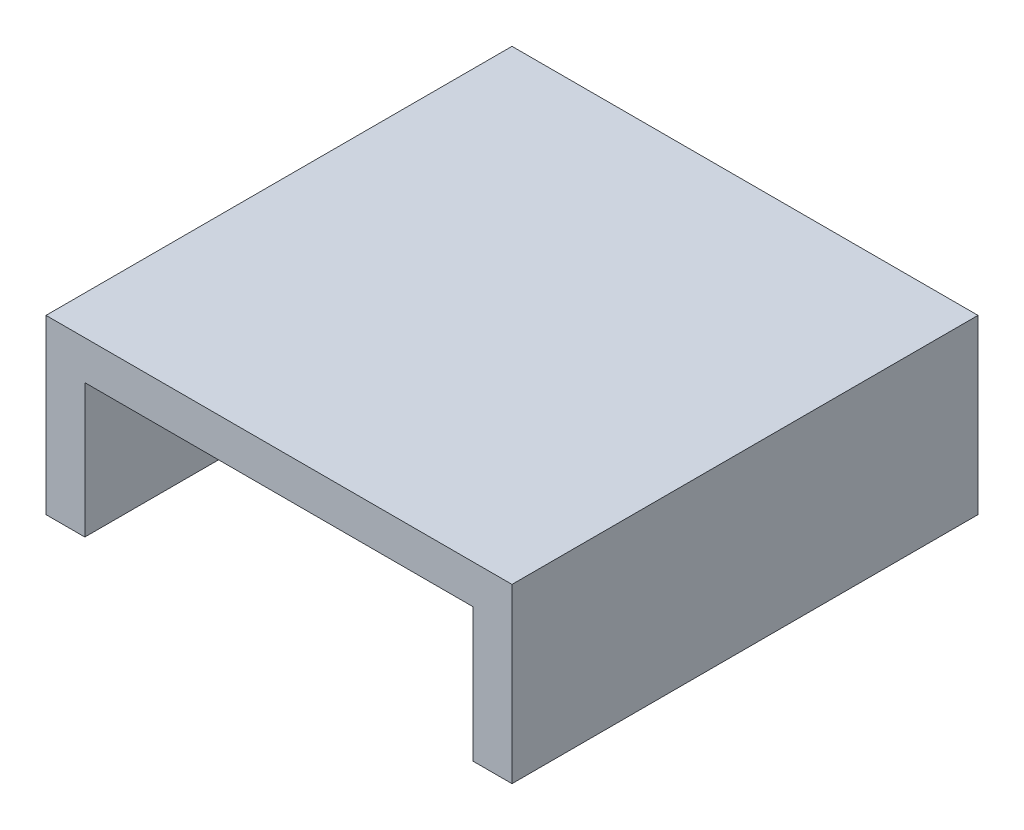
ISO-10303-21;
HEADER;
FILE_DESCRIPTION(('STEP AP214'),'2;1');
FILE_NAME('part.step','',(''),(''),'','','');
FILE_SCHEMA(('AUTOMOTIVE_DESIGN { 1 0 10303 214 1 1 1 1 }'));
ENDSEC;
DATA;
#1=APPLICATION_CONTEXT('core data for automotive mechanical design processes');
#2=APPLICATION_PROTOCOL_DEFINITION('international standard','automotive_design',2000,#1);
#3=PRODUCT_CONTEXT('',#1,'mechanical');
#4=PRODUCT('Part','Part','',(#3));
#5=PRODUCT_RELATED_PRODUCT_CATEGORY('part','',(#4));
#6=PRODUCT_DEFINITION_FORMATION('','',#4);
#7=PRODUCT_DEFINITION_CONTEXT('part definition',#1,'design');
#8=PRODUCT_DEFINITION('design','',#6,#7);
#9=PRODUCT_DEFINITION_SHAPE('','',#8);
#10=(LENGTH_UNIT() NAMED_UNIT(*) SI_UNIT(.MILLI.,.METRE.));
#11=(NAMED_UNIT(*) PLANE_ANGLE_UNIT() SI_UNIT($,.RADIAN.));
#12=(NAMED_UNIT(*) SI_UNIT($,.STERADIAN.) SOLID_ANGLE_UNIT());
#13=UNCERTAINTY_MEASURE_WITH_UNIT(LENGTH_MEASURE(1.E-05),#10,'distance_accuracy_value','');
#14=(GEOMETRIC_REPRESENTATION_CONTEXT(3) GLOBAL_UNCERTAINTY_ASSIGNED_CONTEXT((#13)) GLOBAL_UNIT_ASSIGNED_CONTEXT((#10,
#11,#12)) REPRESENTATION_CONTEXT('',''));
#15=CARTESIAN_POINT('',(0.,0.,0.));
#16=DIRECTION('',(0.,0.,1.));
#17=DIRECTION('',(1.,0.,0.));
#18=AXIS2_PLACEMENT_3D('',#15,#16,#17);
#19=CARTESIAN_POINT('',(-27.,0.,54.));
#20=DIRECTION('',(1.,0.,0.));
#21=DIRECTION('',(0.,1.,0.));
#22=AXIS2_PLACEMENT_3D('',#19,#20,#21);
#23=PLANE('',#22);
#24=DIRECTION('',(0.,-1.,0.));
#25=VECTOR('',#24,1.);
#26=CARTESIAN_POINT('',(-27.,0.,0.));
#27=LINE('',#26,#25);
#28=CARTESIAN_POINT('',(-27.,0.,0.));
#29=VERTEX_POINT('',#28);
#30=CARTESIAN_POINT('',(-27.,-20.,0.));
#31=VERTEX_POINT('',#30);
#32=EDGE_CURVE('E140',#29,#31,#27,.T.);
#33=ORIENTED_EDGE('',*,*,#32,.T.);
#34=DIRECTION('',(0.,0.,-1.));
#35=VECTOR('',#34,1.);
#36=CARTESIAN_POINT('',(-27.,-20.,54.));
#37=LINE('',#36,#35);
#38=CARTESIAN_POINT('',(-27.,-20.,54.));
#39=VERTEX_POINT('',#38);
#40=EDGE_CURVE('E11',#39,#31,#37,.T.);
#41=ORIENTED_EDGE('',*,*,#40,.F.);
#42=DIRECTION('',(0.,-1.,0.));
#43=VECTOR('',#42,1.);
#44=CARTESIAN_POINT('',(-27.,0.,54.));
#45=LINE('',#44,#43);
#46=CARTESIAN_POINT('',(-27.,0.,54.));
#47=VERTEX_POINT('',#46);
#48=EDGE_CURVE('E162',#47,#39,#45,.T.);
#49=ORIENTED_EDGE('',*,*,#48,.F.);
#50=DIRECTION('',(0.,0.,-1.));
#51=VECTOR('',#50,1.);
#52=CARTESIAN_POINT('',(-27.,0.,54.));
#53=LINE('',#52,#51);
#54=EDGE_CURVE('E136',#47,#29,#53,.T.);
#55=ORIENTED_EDGE('',*,*,#54,.T.);
#56=EDGE_LOOP('',(#33,#41,#49,#55));
#57=FACE_BOUND('',#56,.T.);
#58=ADVANCED_FACE('F39',(#57),#23,.F.);
#59=CARTESIAN_POINT('',(-27.,-20.,54.));
#60=DIRECTION('',(0.,1.,0.));
#61=DIRECTION('',(0.,0.,1.));
#62=AXIS2_PLACEMENT_3D('',#59,#60,#61);
#63=PLANE('',#62);
#64=DIRECTION('',(1.,0.,0.));
#65=VECTOR('',#64,1.);
#66=CARTESIAN_POINT('',(-27.,-20.,0.));
#67=LINE('',#66,#65);
#68=CARTESIAN_POINT('',(-22.5,-20.,0.));
#69=VERTEX_POINT('',#68);
#70=EDGE_CURVE('E144',#31,#69,#67,.T.);
#71=ORIENTED_EDGE('',*,*,#70,.T.);
#72=DIRECTION('',(0.,0.,-1.));
#73=VECTOR('',#72,1.);
#74=CARTESIAN_POINT('',(-22.5,-20.,54.));
#75=LINE('',#74,#73);
#76=CARTESIAN_POINT('',(-22.5,-20.,54.));
#77=VERTEX_POINT('',#76);
#78=EDGE_CURVE('E48',#77,#69,#75,.T.);
#79=ORIENTED_EDGE('',*,*,#78,.F.);
#80=DIRECTION('',(1.,0.,0.));
#81=VECTOR('',#80,1.);
#82=CARTESIAN_POINT('',(-27.,-20.,54.));
#83=LINE('',#82,#81);
#84=EDGE_CURVE('E99',#39,#77,#83,.T.);
#85=ORIENTED_EDGE('',*,*,#84,.F.);
#86=ORIENTED_EDGE('',*,*,#40,.T.);
#87=EDGE_LOOP('',(#71,#79,#85,#86));
#88=FACE_BOUND('',#87,.T.);
#89=ADVANCED_FACE('F208',(#88),#63,.F.);
#90=CARTESIAN_POINT('',(-22.5,-20.,54.));
#91=DIRECTION('',(-1.,0.,0.));
#92=DIRECTION('',(0.,-1.,0.));
#93=AXIS2_PLACEMENT_3D('',#90,#91,#92);
#94=PLANE('',#93);
#95=DIRECTION('',(0.,1.,0.));
#96=VECTOR('',#95,1.);
#97=CARTESIAN_POINT('',(-22.5,-20.,0.));
#98=LINE('',#97,#96);
#99=CARTESIAN_POINT('',(-22.5,-4.50000000000001,0.));
#100=VERTEX_POINT('',#99);
#101=EDGE_CURVE('E147',#69,#100,#98,.T.);
#102=ORIENTED_EDGE('',*,*,#101,.T.);
#103=DIRECTION('',(0.,0.,-1.));
#104=VECTOR('',#103,1.);
#105=CARTESIAN_POINT('',(-22.5,-4.50000000000001,54.));
#106=LINE('',#105,#104);
#107=CARTESIAN_POINT('',(-22.5,-4.50000000000001,54.));
#108=VERTEX_POINT('',#107);
#109=EDGE_CURVE('E173',#108,#100,#106,.T.);
#110=ORIENTED_EDGE('',*,*,#109,.F.);
#111=DIRECTION('',(0.,1.,0.));
#112=VECTOR('',#111,1.);
#113=CARTESIAN_POINT('',(-22.5,-20.,54.));
#114=LINE('',#113,#112);
#115=EDGE_CURVE('E183',#77,#108,#114,.T.);
#116=ORIENTED_EDGE('',*,*,#115,.F.);
#117=ORIENTED_EDGE('',*,*,#78,.T.);
#118=EDGE_LOOP('',(#102,#110,#116,#117));
#119=FACE_BOUND('',#118,.T.);
#120=ADVANCED_FACE('F181',(#119),#94,.F.);
#121=CARTESIAN_POINT('',(-22.5,-4.50000000000001,54.));
#122=DIRECTION('',(0.,1.,0.));
#123=DIRECTION('',(-1.,0.,0.));
#124=AXIS2_PLACEMENT_3D('',#121,#122,#123);
#125=PLANE('',#124);
#126=DIRECTION('',(1.,0.,0.));
#127=VECTOR('',#126,1.);
#128=CARTESIAN_POINT('',(-22.5,-4.50000000000001,0.));
#129=LINE('',#128,#127);
#130=CARTESIAN_POINT('',(22.5,-4.5,0.));
#131=VERTEX_POINT('',#130);
#132=EDGE_CURVE('E150',#100,#131,#129,.T.);
#133=ORIENTED_EDGE('',*,*,#132,.T.);
#134=DIRECTION('',(0.,0.,-1.));
#135=VECTOR('',#134,1.);
#136=CARTESIAN_POINT('',(22.5,-4.5,54.));
#137=LINE('',#136,#135);
#138=CARTESIAN_POINT('',(22.5,-4.5,54.));
#139=VERTEX_POINT('',#138);
#140=EDGE_CURVE('E169',#139,#131,#137,.T.);
#141=ORIENTED_EDGE('',*,*,#140,.F.);
#142=DIRECTION('',(1.,0.,0.));
#143=VECTOR('',#142,1.);
#144=CARTESIAN_POINT('',(-22.5,-4.50000000000001,54.));
#145=LINE('',#144,#143);
#146=EDGE_CURVE('E196',#108,#139,#145,.T.);
#147=ORIENTED_EDGE('',*,*,#146,.F.);
#148=ORIENTED_EDGE('',*,*,#109,.T.);
#149=EDGE_LOOP('',(#133,#141,#147,#148));
#150=FACE_BOUND('',#149,.T.);
#151=ADVANCED_FACE('F191',(#150),#125,.F.);
#152=CARTESIAN_POINT('',(22.5,-4.5,54.));
#153=DIRECTION('',(1.,0.,0.));
#154=DIRECTION('',(0.,0.,-1.));
#155=AXIS2_PLACEMENT_3D('',#152,#153,#154);
#156=PLANE('',#155);
#157=DIRECTION('',(0.,-1.,0.));
#158=VECTOR('',#157,1.);
#159=CARTESIAN_POINT('',(22.5,-4.5,0.));
#160=LINE('',#159,#158);
#161=CARTESIAN_POINT('',(22.5,-20.,0.));
#162=VERTEX_POINT('',#161);
#163=EDGE_CURVE('E153',#131,#162,#160,.T.);
#164=ORIENTED_EDGE('',*,*,#163,.T.);
#165=DIRECTION('',(0.,0.,-1.));
#166=VECTOR('',#165,1.);
#167=CARTESIAN_POINT('',(22.5,-20.,54.));
#168=LINE('',#167,#166);
#169=CARTESIAN_POINT('',(22.5,-20.,54.));
#170=VERTEX_POINT('',#169);
#171=EDGE_CURVE('E129',#170,#162,#168,.T.);
#172=ORIENTED_EDGE('',*,*,#171,.F.);
#173=DIRECTION('',(0.,-1.,0.));
#174=VECTOR('',#173,1.);
#175=CARTESIAN_POINT('',(22.5,-4.5,54.));
#176=LINE('',#175,#174);
#177=EDGE_CURVE('E118',#139,#170,#176,.T.);
#178=ORIENTED_EDGE('',*,*,#177,.F.);
#179=ORIENTED_EDGE('',*,*,#140,.T.);
#180=EDGE_LOOP('',(#164,#172,#178,#179));
#181=FACE_BOUND('',#180,.T.);
#182=ADVANCED_FACE('F194',(#181),#156,.F.);
#183=CARTESIAN_POINT('',(22.5,-20.,54.));
#184=DIRECTION('',(0.,1.,0.));
#185=DIRECTION('',(0.,0.,1.));
#186=AXIS2_PLACEMENT_3D('',#183,#184,#185);
#187=PLANE('',#186);
#188=DIRECTION('',(1.,0.,0.));
#189=VECTOR('',#188,1.);
#190=CARTESIAN_POINT('',(22.5,-20.,0.));
#191=LINE('',#190,#189);
#192=CARTESIAN_POINT('',(27.,-20.,0.));
#193=VERTEX_POINT('',#192);
#194=EDGE_CURVE('E127',#162,#193,#191,.T.);
#195=ORIENTED_EDGE('',*,*,#194,.T.);
#196=DIRECTION('',(0.,0.,-1.));
#197=VECTOR('',#196,1.);
#198=CARTESIAN_POINT('',(27.,-20.,54.));
#199=LINE('',#198,#197);
#200=CARTESIAN_POINT('',(27.,-20.,54.));
#201=VERTEX_POINT('',#200);
#202=EDGE_CURVE('E124',#201,#193,#199,.T.);
#203=ORIENTED_EDGE('',*,*,#202,.F.);
#204=DIRECTION('',(1.,0.,0.));
#205=VECTOR('',#204,1.);
#206=CARTESIAN_POINT('',(22.5,-20.,54.));
#207=LINE('',#206,#205);
#208=EDGE_CURVE('E112',#170,#201,#207,.T.);
#209=ORIENTED_EDGE('',*,*,#208,.F.);
#210=ORIENTED_EDGE('',*,*,#171,.T.);
#211=EDGE_LOOP('',(#195,#203,#209,#210));
#212=FACE_BOUND('',#211,.T.);
#213=ADVANCED_FACE('F125',(#212),#187,.F.);
#214=CARTESIAN_POINT('',(27.,0.,54.));
#215=DIRECTION('',(-1.,0.,0.));
#216=DIRECTION('',(0.,0.,1.));
#217=AXIS2_PLACEMENT_3D('',#214,#215,#216);
#218=PLANE('',#217);
#219=DIRECTION('',(0.,1.,0.));
#220=VECTOR('',#219,1.);
#221=CARTESIAN_POINT('',(27.,0.,0.));
#222=LINE('',#221,#220);
#223=CARTESIAN_POINT('',(27.,0.,0.));
#224=VERTEX_POINT('',#223);
#225=EDGE_CURVE('E85',#193,#224,#222,.T.);
#226=ORIENTED_EDGE('',*,*,#225,.T.);
#227=DIRECTION('',(0.,0.,-1.));
#228=VECTOR('',#227,1.);
#229=CARTESIAN_POINT('',(27.,0.,54.));
#230=LINE('',#229,#228);
#231=CARTESIAN_POINT('',(27.,0.,54.));
#232=VERTEX_POINT('',#231);
#233=EDGE_CURVE('E130',#232,#224,#230,.T.);
#234=ORIENTED_EDGE('',*,*,#233,.F.);
#235=DIRECTION('',(0.,1.,0.));
#236=VECTOR('',#235,1.);
#237=CARTESIAN_POINT('',(27.,0.,54.));
#238=LINE('',#237,#236);
#239=EDGE_CURVE('E116',#201,#232,#238,.T.);
#240=ORIENTED_EDGE('',*,*,#239,.F.);
#241=ORIENTED_EDGE('',*,*,#202,.T.);
#242=EDGE_LOOP('',(#226,#234,#240,#241));
#243=FACE_BOUND('',#242,.T.);
#244=ADVANCED_FACE('F132',(#243),#218,.F.);
#245=CARTESIAN_POINT('',(27.,0.,54.));
#246=DIRECTION('',(0.,-1.,0.));
#247=DIRECTION('',(1.,0.,0.));
#248=AXIS2_PLACEMENT_3D('',#245,#246,#247);
#249=PLANE('',#248);
#250=DIRECTION('',(-1.,0.,0.));
#251=VECTOR('',#250,1.);
#252=CARTESIAN_POINT('',(27.,0.,0.));
#253=LINE('',#252,#251);
#254=EDGE_CURVE('E91',#224,#29,#253,.T.);
#255=ORIENTED_EDGE('',*,*,#254,.T.);
#256=ORIENTED_EDGE('',*,*,#54,.F.);
#257=DIRECTION('',(-1.,0.,0.));
#258=VECTOR('',#257,1.);
#259=CARTESIAN_POINT('',(27.,0.,54.));
#260=LINE('',#259,#258);
#261=EDGE_CURVE('E56',#232,#47,#260,.T.);
#262=ORIENTED_EDGE('',*,*,#261,.F.);
#263=ORIENTED_EDGE('',*,*,#233,.T.);
#264=EDGE_LOOP('',(#255,#256,#262,#263));
#265=FACE_BOUND('',#264,.T.);
#266=ADVANCED_FACE('F224',(#265),#249,.F.);
#267=CARTESIAN_POINT('',(0.,0.,54.));
#268=DIRECTION('',(0.,0.,1.));
#269=DIRECTION('',(1.,0.,0.));
#270=AXIS2_PLACEMENT_3D('',#267,#268,#269);
#271=PLANE('',#270);
#272=ORIENTED_EDGE('',*,*,#48,.T.);
#273=ORIENTED_EDGE('',*,*,#84,.T.);
#274=ORIENTED_EDGE('',*,*,#115,.T.);
#275=ORIENTED_EDGE('',*,*,#146,.T.);
#276=ORIENTED_EDGE('',*,*,#177,.T.);
#277=ORIENTED_EDGE('',*,*,#208,.T.);
#278=ORIENTED_EDGE('',*,*,#239,.T.);
#279=ORIENTED_EDGE('',*,*,#261,.T.);
#280=EDGE_LOOP('',(#272,#273,#274,#275,#276,#277,#278,#279));
#281=FACE_BOUND('',#280,.T.);
#282=ADVANCED_FACE('F114',(#281),#271,.T.);
#283=CARTESIAN_POINT('',(0.,0.,0.));
#284=DIRECTION('',(0.,0.,1.));
#285=DIRECTION('',(1.,0.,0.));
#286=AXIS2_PLACEMENT_3D('',#283,#284,#285);
#287=PLANE('',#286);
#288=ORIENTED_EDGE('',*,*,#32,.F.);
#289=ORIENTED_EDGE('',*,*,#254,.F.);
#290=ORIENTED_EDGE('',*,*,#225,.F.);
#291=ORIENTED_EDGE('',*,*,#194,.F.);
#292=ORIENTED_EDGE('',*,*,#163,.F.);
#293=ORIENTED_EDGE('',*,*,#132,.F.);
#294=ORIENTED_EDGE('',*,*,#101,.F.);
#295=ORIENTED_EDGE('',*,*,#70,.F.);
#296=EDGE_LOOP('',(#288,#289,#290,#291,#292,#293,#294,#295));
#297=FACE_BOUND('',#296,.T.);
#298=ADVANCED_FACE('F187',(#297),#287,.F.);
#299=CLOSED_SHELL('',(#58,#89,#120,#151,#182,#213,#244,#266,#282,#298));
#300=MANIFOLD_SOLID_BREP('B2',#299);
#301=ADVANCED_BREP_SHAPE_REPRESENTATION('',(#18,#300),#14);
#302=SHAPE_DEFINITION_REPRESENTATION(#9,#301);
ENDSEC;
END-ISO-10303-21;
